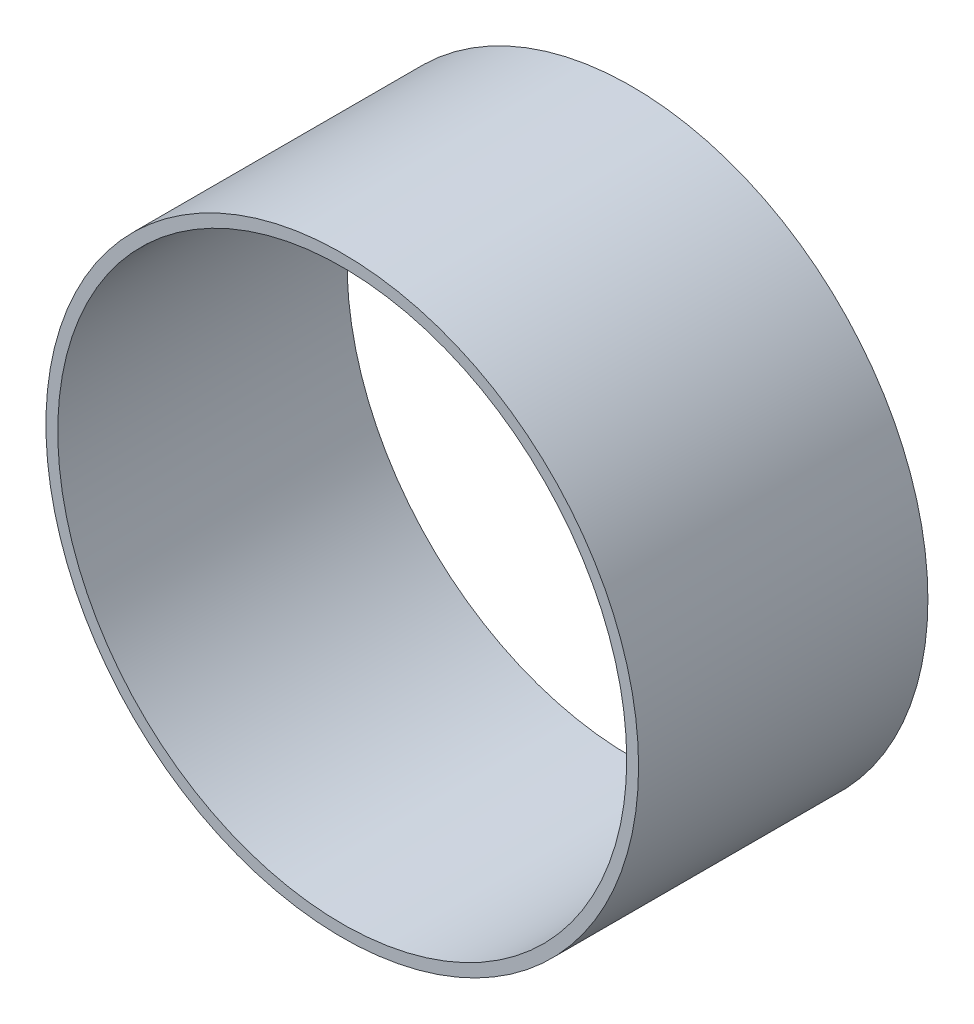
ISO-10303-21;
HEADER;
FILE_DESCRIPTION(('STEP AP214'),'2;1');
FILE_NAME('part.step','',(''),(''),'','','');
FILE_SCHEMA(('AUTOMOTIVE_DESIGN { 1 0 10303 214 1 1 1 1 }'));
ENDSEC;
DATA;
#1=APPLICATION_CONTEXT('core data for automotive mechanical design processes');
#2=APPLICATION_PROTOCOL_DEFINITION('international standard','automotive_design',2000,#1);
#3=PRODUCT_CONTEXT('',#1,'mechanical');
#4=PRODUCT('Part','Part','',(#3));
#5=PRODUCT_RELATED_PRODUCT_CATEGORY('part','',(#4));
#6=PRODUCT_DEFINITION_FORMATION('','',#4);
#7=PRODUCT_DEFINITION_CONTEXT('part definition',#1,'design');
#8=PRODUCT_DEFINITION('design','',#6,#7);
#9=PRODUCT_DEFINITION_SHAPE('','',#8);
#10=(LENGTH_UNIT() NAMED_UNIT(*) SI_UNIT(.MILLI.,.METRE.));
#11=(NAMED_UNIT(*) PLANE_ANGLE_UNIT() SI_UNIT($,.RADIAN.));
#12=(NAMED_UNIT(*) SI_UNIT($,.STERADIAN.) SOLID_ANGLE_UNIT());
#13=UNCERTAINTY_MEASURE_WITH_UNIT(LENGTH_MEASURE(1.E-05),#10,'distance_accuracy_value','');
#14=(GEOMETRIC_REPRESENTATION_CONTEXT(3) GLOBAL_UNCERTAINTY_ASSIGNED_CONTEXT((#13)) GLOBAL_UNIT_ASSIGNED_CONTEXT((#10,
#11,#12)) REPRESENTATION_CONTEXT('',''));
#15=CARTESIAN_POINT('',(0.,0.,0.));
#16=DIRECTION('',(0.,0.,1.));
#17=DIRECTION('',(1.,0.,0.));
#18=AXIS2_PLACEMENT_3D('',#15,#16,#17);
#19=CARTESIAN_POINT('',(0.,0.,0.));
#20=DIRECTION('',(0.,0.,1.));
#21=DIRECTION('',(-1.,0.,0.));
#22=AXIS2_PLACEMENT_3D('',#19,#20,#21);
#23=CYLINDRICAL_SURFACE('',#22,38.1);
#24=CARTESIAN_POINT('',(0.,0.,0.));
#25=DIRECTION('',(0.,0.,1.));
#26=DIRECTION('',(-1.,0.,0.));
#27=AXIS2_PLACEMENT_3D('',#24,#25,#26);
#28=CIRCLE('',#27,38.1);
#29=CARTESIAN_POINT('',(38.1,0.,0.));
#30=VERTEX_POINT('',#29);
#31=EDGE_CURVE('E39',#30,#30,#28,.T.);
#32=ORIENTED_EDGE('',*,*,#31,.F.);
#33=DIRECTION('',(0.,0.,1.));
#34=VECTOR('',#33,1.);
#35=CARTESIAN_POINT('',(38.1,0.,0.));
#36=LINE('',#35,#34);
#37=CARTESIAN_POINT('',(38.1,0.,38.75));
#38=VERTEX_POINT('',#37);
#39=EDGE_CURVE('E10',#30,#38,#36,.T.);
#40=ORIENTED_EDGE('',*,*,#39,.T.);
#41=CARTESIAN_POINT('',(0.,0.,38.75));
#42=DIRECTION('',(0.,0.,-1.));
#43=DIRECTION('',(-1.,0.,0.));
#44=AXIS2_PLACEMENT_3D('',#41,#42,#43);
#45=CIRCLE('',#44,38.1);
#46=EDGE_CURVE('E20',#38,#38,#45,.T.);
#47=ORIENTED_EDGE('',*,*,#46,.F.);
#48=ORIENTED_EDGE('',*,*,#39,.F.);
#49=EDGE_LOOP('',(#32,#40,#47,#48));
#50=FACE_BOUND('',#49,.T.);
#51=ADVANCED_FACE('F16',(#50),#23,.F.);
#52=CARTESIAN_POINT('',(0.,0.,0.));
#53=DIRECTION('',(0.,0.,1.));
#54=DIRECTION('',(-1.,0.,0.));
#55=AXIS2_PLACEMENT_3D('',#52,#53,#54);
#56=CYLINDRICAL_SURFACE('',#55,39.6875);
#57=CARTESIAN_POINT('',(0.,0.,38.75));
#58=DIRECTION('',(0.,0.,1.));
#59=DIRECTION('',(-1.,0.,0.));
#60=AXIS2_PLACEMENT_3D('',#57,#58,#59);
#61=CIRCLE('',#60,39.6875);
#62=CARTESIAN_POINT('',(39.6875,0.,38.75));
#63=VERTEX_POINT('',#62);
#64=EDGE_CURVE('E51',#63,#63,#61,.T.);
#65=ORIENTED_EDGE('',*,*,#64,.F.);
#66=DIRECTION('',(0.,0.,-1.));
#67=VECTOR('',#66,1.);
#68=CARTESIAN_POINT('',(39.6875,0.,0.));
#69=LINE('',#68,#67);
#70=CARTESIAN_POINT('',(39.6875,0.,0.));
#71=VERTEX_POINT('',#70);
#72=EDGE_CURVE('E27',#63,#71,#69,.T.);
#73=ORIENTED_EDGE('',*,*,#72,.T.);
#74=CARTESIAN_POINT('',(0.,0.,0.));
#75=DIRECTION('',(0.,0.,-1.));
#76=DIRECTION('',(-1.,0.,0.));
#77=AXIS2_PLACEMENT_3D('',#74,#75,#76);
#78=CIRCLE('',#77,39.6875);
#79=EDGE_CURVE('E56',#71,#71,#78,.T.);
#80=ORIENTED_EDGE('',*,*,#79,.F.);
#81=ORIENTED_EDGE('',*,*,#72,.F.);
#82=EDGE_LOOP('',(#65,#73,#80,#81));
#83=FACE_BOUND('',#82,.T.);
#84=ADVANCED_FACE('F57',(#83),#56,.T.);
#85=CARTESIAN_POINT('',(0.,0.,0.));
#86=DIRECTION('',(0.,0.,1.));
#87=DIRECTION('',(1.,0.,0.));
#88=AXIS2_PLACEMENT_3D('',#85,#86,#87);
#89=PLANE('',#88);
#90=ORIENTED_EDGE('',*,*,#79,.T.);
#91=EDGE_LOOP('',(#90));
#92=FACE_BOUND('',#91,.T.);
#93=ORIENTED_EDGE('',*,*,#31,.T.);
#94=EDGE_LOOP('',(#93));
#95=FACE_BOUND('',#94,.T.);
#96=ADVANCED_FACE('F18',(#92,#95),#89,.F.);
#97=CARTESIAN_POINT('',(0.,0.,38.75));
#98=DIRECTION('',(0.,0.,1.));
#99=DIRECTION('',(1.,0.,0.));
#100=AXIS2_PLACEMENT_3D('',#97,#98,#99);
#101=PLANE('',#100);
#102=ORIENTED_EDGE('',*,*,#64,.T.);
#103=EDGE_LOOP('',(#102));
#104=FACE_BOUND('',#103,.T.);
#105=ORIENTED_EDGE('',*,*,#46,.T.);
#106=EDGE_LOOP('',(#105));
#107=FACE_BOUND('',#106,.T.);
#108=ADVANCED_FACE('F77',(#104,#107),#101,.T.);
#109=CLOSED_SHELL('',(#51,#84,#96,#108));
#110=MANIFOLD_SOLID_BREP('B1',#109);
#111=ADVANCED_BREP_SHAPE_REPRESENTATION('',(#18,#110),#14);
#112=SHAPE_DEFINITION_REPRESENTATION(#9,#111);
ENDSEC;
END-ISO-10303-21;
